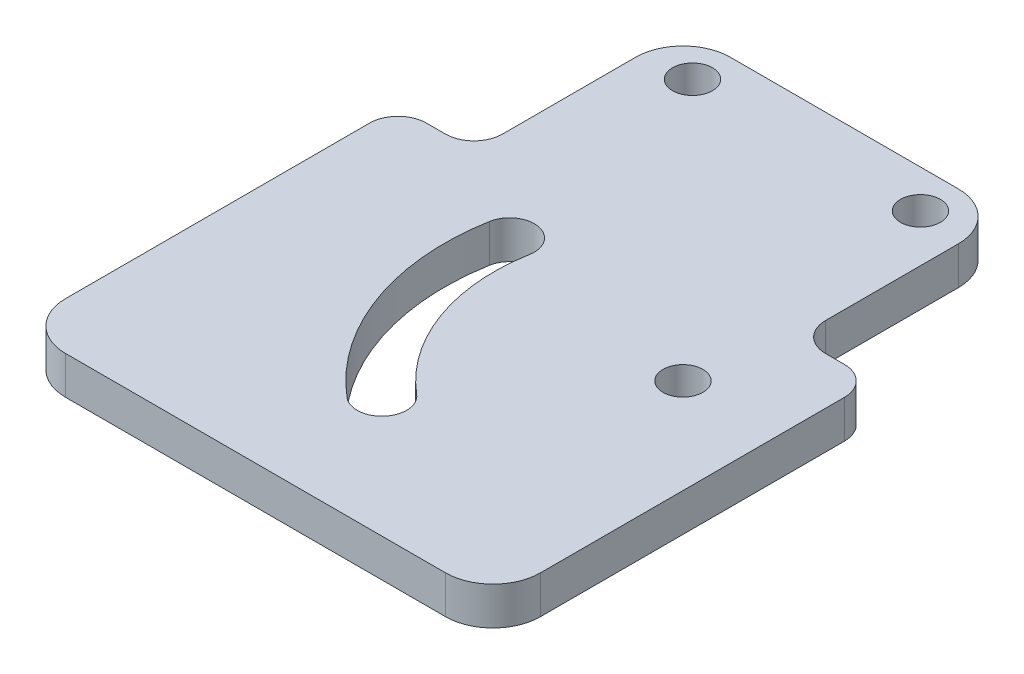
ISO-10303-21;
HEADER;
FILE_DESCRIPTION(('STEP AP214'),'2;1');
FILE_NAME('part.step','',(''),(''),'','','');
FILE_SCHEMA(('AUTOMOTIVE_DESIGN { 1 0 10303 214 1 1 1 1 }'));
ENDSEC;
DATA;
#1=APPLICATION_CONTEXT('core data for automotive mechanical design processes');
#2=APPLICATION_PROTOCOL_DEFINITION('international standard','automotive_design',2000,#1);
#3=PRODUCT_CONTEXT('',#1,'mechanical');
#4=PRODUCT('Part','Part','',(#3));
#5=PRODUCT_RELATED_PRODUCT_CATEGORY('part','',(#4));
#6=PRODUCT_DEFINITION_FORMATION('','',#4);
#7=PRODUCT_DEFINITION_CONTEXT('part definition',#1,'design');
#8=PRODUCT_DEFINITION('design','',#6,#7);
#9=PRODUCT_DEFINITION_SHAPE('','',#8);
#10=(LENGTH_UNIT() NAMED_UNIT(*) SI_UNIT(.MILLI.,.METRE.));
#11=(NAMED_UNIT(*) PLANE_ANGLE_UNIT() SI_UNIT($,.RADIAN.));
#12=(NAMED_UNIT(*) SI_UNIT($,.STERADIAN.) SOLID_ANGLE_UNIT());
#13=UNCERTAINTY_MEASURE_WITH_UNIT(LENGTH_MEASURE(1.E-05),#10,'distance_accuracy_value','');
#14=(GEOMETRIC_REPRESENTATION_CONTEXT(3) GLOBAL_UNCERTAINTY_ASSIGNED_CONTEXT((#13)) GLOBAL_UNIT_ASSIGNED_CONTEXT((#10,
#11,#12)) REPRESENTATION_CONTEXT('',''));
#15=CARTESIAN_POINT('',(0.,0.,0.));
#16=DIRECTION('',(0.,0.,1.));
#17=DIRECTION('',(1.,0.,0.));
#18=AXIS2_PLACEMENT_3D('',#15,#16,#17);
#19=CARTESIAN_POINT('',(-40.,4.,-10.));
#20=DIRECTION('',(0.,0.,1.));
#21=DIRECTION('',(1.,0.,0.));
#22=AXIS2_PLACEMENT_3D('',#19,#20,#21);
#23=PLANE('',#22);
#24=DIRECTION('',(-1.,0.,0.));
#25=VECTOR('',#24,1.);
#26=CARTESIAN_POINT('',(-40.,0.,-10.));
#27=LINE('',#26,#25);
#28=CARTESIAN_POINT('',(-35.,0.,-10.));
#29=VERTEX_POINT('',#28);
#30=CARTESIAN_POINT('',(-37.,0.,-10.));
#31=VERTEX_POINT('',#30);
#32=EDGE_CURVE('E247',#29,#31,#27,.T.);
#33=ORIENTED_EDGE('',*,*,#32,.T.);
#34=DIRECTION('',(0.,-1.,0.));
#35=VECTOR('',#34,1.);
#36=CARTESIAN_POINT('',(-37.,4.,-10.));
#37=LINE('',#36,#35);
#38=CARTESIAN_POINT('',(-37.,4.,-10.));
#39=VERTEX_POINT('',#38);
#40=EDGE_CURVE('E276',#31,#39,#37,.F.);
#41=ORIENTED_EDGE('',*,*,#40,.T.);
#42=DIRECTION('',(-1.,0.,0.));
#43=VECTOR('',#42,1.);
#44=CARTESIAN_POINT('',(-40.,4.,-10.));
#45=LINE('',#44,#43);
#46=CARTESIAN_POINT('',(-35.,4.,-10.));
#47=VERTEX_POINT('',#46);
#48=EDGE_CURVE('E237',#47,#39,#45,.T.);
#49=ORIENTED_EDGE('',*,*,#48,.F.);
#50=DIRECTION('',(0.,1.,0.));
#51=VECTOR('',#50,1.);
#52=CARTESIAN_POINT('',(-35.,4.,-10.));
#53=LINE('',#52,#51);
#54=EDGE_CURVE('E274',#47,#29,#53,.F.);
#55=ORIENTED_EDGE('',*,*,#54,.T.);
#56=EDGE_LOOP('',(#33,#41,#49,#55));
#57=FACE_BOUND('',#56,.T.);
#58=ADVANCED_FACE('F39',(#57),#23,.F.);
#59=CARTESIAN_POINT('',(0.,4.,0.));
#60=DIRECTION('',(0.,1.,0.));
#61=DIRECTION('',(0.,0.,1.));
#62=AXIS2_PLACEMENT_3D('',#59,#60,#61);
#63=PLANE('',#62);
#64=DIRECTION('',(0.,0.,1.));
#65=VECTOR('',#64,1.);
#66=CARTESIAN_POINT('',(2.00000000000001,4.,0.));
#67=LINE('',#66,#65);
#68=CARTESIAN_POINT('',(2.,4.,-27.));
#69=VERTEX_POINT('',#68);
#70=CARTESIAN_POINT('',(2.00000000000001,4.,-13.));
#71=VERTEX_POINT('',#70);
#72=EDGE_CURVE('E350',#69,#71,#67,.T.);
#73=ORIENTED_EDGE('',*,*,#72,.F.);
#74=CARTESIAN_POINT('',(-3.,4.,-27.));
#75=DIRECTION('',(0.,1.,0.));
#76=DIRECTION('',(0.,0.,1.));
#77=AXIS2_PLACEMENT_3D('',#74,#75,#76);
#78=CIRCLE('',#77,5.);
#79=CARTESIAN_POINT('',(-3.,4.,-32.));
#80=VERTEX_POINT('',#79);
#81=EDGE_CURVE('E300',#69,#80,#78,.T.);
#82=ORIENTED_EDGE('',*,*,#81,.T.);
#83=DIRECTION('',(1.,0.,0.));
#84=VECTOR('',#83,1.);
#85=CARTESIAN_POINT('',(0.,4.,-32.));
#86=LINE('',#85,#84);
#87=CARTESIAN_POINT('',(-27.,4.,-32.));
#88=VERTEX_POINT('',#87);
#89=EDGE_CURVE('E354',#88,#80,#86,.T.);
#90=ORIENTED_EDGE('',*,*,#89,.F.);
#91=CARTESIAN_POINT('',(-27.,4.,-27.));
#92=DIRECTION('',(0.,1.,0.));
#93=DIRECTION('',(0.,0.,1.));
#94=AXIS2_PLACEMENT_3D('',#91,#92,#93);
#95=CIRCLE('',#94,5.);
#96=CARTESIAN_POINT('',(-32.,4.,-27.));
#97=VERTEX_POINT('',#96);
#98=EDGE_CURVE('E294',#88,#97,#95,.T.);
#99=ORIENTED_EDGE('',*,*,#98,.T.);
#100=DIRECTION('',(0.,0.,1.));
#101=VECTOR('',#100,1.);
#102=CARTESIAN_POINT('',(-32.,4.,0.));
#103=LINE('',#102,#101);
#104=CARTESIAN_POINT('',(-32.,4.,-13.));
#105=VERTEX_POINT('',#104);
#106=EDGE_CURVE('E356',#97,#105,#103,.T.);
#107=ORIENTED_EDGE('',*,*,#106,.T.);
#108=CARTESIAN_POINT('',(-35.,4.,-13.));
#109=DIRECTION('',(0.,1.,0.));
#110=DIRECTION('',(0.,0.,1.));
#111=AXIS2_PLACEMENT_3D('',#108,#109,#110);
#112=CIRCLE('',#111,3.);
#113=EDGE_CURVE('E286',#105,#47,#112,.F.);
#114=ORIENTED_EDGE('',*,*,#113,.T.);
#115=ORIENTED_EDGE('',*,*,#48,.T.);
#116=CARTESIAN_POINT('',(-37.,4.,-7.));
#117=DIRECTION('',(0.,1.,0.));
#118=DIRECTION('',(0.,0.,1.));
#119=AXIS2_PLACEMENT_3D('',#116,#117,#118);
#120=CIRCLE('',#119,3.);
#121=CARTESIAN_POINT('',(-40.,4.,-7.));
#122=VERTEX_POINT('',#121);
#123=EDGE_CURVE('E264',#39,#122,#120,.T.);
#124=ORIENTED_EDGE('',*,*,#123,.T.);
#125=DIRECTION('',(0.,0.,1.));
#126=VECTOR('',#125,1.);
#127=CARTESIAN_POINT('',(-40.,4.,-10.));
#128=LINE('',#127,#126);
#129=CARTESIAN_POINT('',(-40.,4.,25.));
#130=VERTEX_POINT('',#129);
#131=EDGE_CURVE('E228',#122,#130,#128,.T.);
#132=ORIENTED_EDGE('',*,*,#131,.T.);
#133=CARTESIAN_POINT('',(-35.,4.,25.));
#134=DIRECTION('',(0.,1.,0.));
#135=DIRECTION('',(0.,0.,1.));
#136=AXIS2_PLACEMENT_3D('',#133,#134,#135);
#137=CIRCLE('',#136,5.);
#138=CARTESIAN_POINT('',(-35.,4.,30.));
#139=VERTEX_POINT('',#138);
#140=EDGE_CURVE('E298',#130,#139,#137,.T.);
#141=ORIENTED_EDGE('',*,*,#140,.T.);
#142=DIRECTION('',(1.,0.,0.));
#143=VECTOR('',#142,1.);
#144=CARTESIAN_POINT('',(-40.,4.,30.));
#145=LINE('',#144,#143);
#146=CARTESIAN_POINT('',(5.,4.,30.));
#147=VERTEX_POINT('',#146);
#148=EDGE_CURVE('E231',#139,#147,#145,.T.);
#149=ORIENTED_EDGE('',*,*,#148,.T.);
#150=CARTESIAN_POINT('',(5.00000000000001,4.,25.));
#151=DIRECTION('',(0.,1.,0.));
#152=DIRECTION('',(0.,0.,1.));
#153=AXIS2_PLACEMENT_3D('',#150,#151,#152);
#154=CIRCLE('',#153,5.);
#155=CARTESIAN_POINT('',(10.,4.,25.));
#156=VERTEX_POINT('',#155);
#157=EDGE_CURVE('E296',#147,#156,#154,.T.);
#158=ORIENTED_EDGE('',*,*,#157,.T.);
#159=DIRECTION('',(0.,0.,-1.));
#160=VECTOR('',#159,1.);
#161=CARTESIAN_POINT('',(9.99999999999999,4.,-10.));
#162=LINE('',#161,#160);
#163=CARTESIAN_POINT('',(10.,4.,-7.));
#164=VERTEX_POINT('',#163);
#165=EDGE_CURVE('E235',#156,#164,#162,.T.);
#166=ORIENTED_EDGE('',*,*,#165,.T.);
#167=CARTESIAN_POINT('',(6.99999999999999,4.,-7.));
#168=DIRECTION('',(0.,1.,0.));
#169=DIRECTION('',(0.,0.,1.));
#170=AXIS2_PLACEMENT_3D('',#167,#168,#169);
#171=CIRCLE('',#170,3.);
#172=CARTESIAN_POINT('',(6.99999999999998,4.,-10.));
#173=VERTEX_POINT('',#172);
#174=EDGE_CURVE('E266',#164,#173,#171,.T.);
#175=ORIENTED_EDGE('',*,*,#174,.T.);
#176=CARTESIAN_POINT('',(4.99999999999999,4.,-10.));
#177=VERTEX_POINT('',#176);
#178=EDGE_CURVE('E240',#173,#177,#45,.T.);
#179=ORIENTED_EDGE('',*,*,#178,.T.);
#180=CARTESIAN_POINT('',(5.,4.,-13.));
#181=DIRECTION('',(0.,1.,0.));
#182=DIRECTION('',(0.,0.,1.));
#183=AXIS2_PLACEMENT_3D('',#180,#181,#182);
#184=CIRCLE('',#183,3.);
#185=EDGE_CURVE('E281',#177,#71,#184,.F.);
#186=ORIENTED_EDGE('',*,*,#185,.T.);
#187=EDGE_LOOP('',(#73,#82,#90,#99,#107,#114,#115,#124,#132,#141,#149,#158,#166,#175,#179,#186));
#188=FACE_BOUND('',#187,.T.);
#189=CARTESIAN_POINT('',(0.,4.,0.));
#190=DIRECTION('',(0.,1.,0.));
#191=DIRECTION('',(0.,0.,1.));
#192=AXIS2_PLACEMENT_3D('',#189,#190,#191);
#193=CIRCLE('',#192,2.1);
#194=CARTESIAN_POINT('',(0.,4.,2.1));
#195=VERTEX_POINT('',#194);
#196=EDGE_CURVE('E222',#195,#195,#193,.T.);
#197=ORIENTED_EDGE('',*,*,#196,.F.);
#198=EDGE_LOOP('',(#197));
#199=FACE_BOUND('',#198,.T.);
#200=CARTESIAN_POINT('',(0.,4.,0.));
#201=DIRECTION('',(0.,1.,0.));
#202=DIRECTION('',(0.,0.,1.));
#203=AXIS2_PLACEMENT_3D('',#200,#201,#202);
#204=CIRCLE('',#203,25.1);
#205=CARTESIAN_POINT('',(-24.7186746006064,4.,-4.35856925943977));
#206=VERTEX_POINT('',#205);
#207=CARTESIAN_POINT('',(-16.1339690031321,4.,19.2277155222864));
#208=VERTEX_POINT('',#207);
#209=EDGE_CURVE('E187',#206,#208,#204,.T.);
#210=ORIENTED_EDGE('',*,*,#209,.F.);
#211=CARTESIAN_POINT('',(-22.1581744427747,4.,-3.90708399750578));
#212=DIRECTION('',(0.,1.,0.));
#213=DIRECTION('',(0.,0.,1.));
#214=AXIS2_PLACEMENT_3D('',#211,#212,#213);
#215=CIRCLE('',#214,2.6);
#216=CARTESIAN_POINT('',(-19.597674284943,4.,-3.45559873557177));
#217=VERTEX_POINT('',#216);
#218=EDGE_CURVE('E177',#217,#206,#215,.T.);
#219=ORIENTED_EDGE('',*,*,#218,.F.);
#220=CARTESIAN_POINT('',(0.,4.,0.));
#221=DIRECTION('',(0.,-1.,0.));
#222=DIRECTION('',(0.,0.,1.));
#223=AXIS2_PLACEMENT_3D('',#220,#221,#222);
#224=CIRCLE('',#223,19.9);
#225=CARTESIAN_POINT('',(-12.7914734327621,4.,15.2442844180677));
#226=VERTEX_POINT('',#225);
#227=EDGE_CURVE('E204',#226,#217,#224,.T.);
#228=ORIENTED_EDGE('',*,*,#227,.F.);
#229=CARTESIAN_POINT('',(-14.4627212179471,4.,17.235999970177));
#230=DIRECTION('',(0.,1.,0.));
#231=DIRECTION('',(0.,0.,1.));
#232=AXIS2_PLACEMENT_3D('',#229,#230,#231);
#233=CIRCLE('',#232,2.6);
#234=EDGE_CURVE('E202',#208,#226,#233,.T.);
#235=ORIENTED_EDGE('',*,*,#234,.F.);
#236=EDGE_LOOP('',(#210,#219,#228,#235));
#237=FACE_BOUND('',#236,.T.);
#238=CARTESIAN_POINT('',(-3.,4.,-28.));
#239=DIRECTION('',(0.,1.,0.));
#240=DIRECTION('',(0.,0.,1.));
#241=AXIS2_PLACEMENT_3D('',#238,#239,#240);
#242=CIRCLE('',#241,2.1);
#243=CARTESIAN_POINT('',(-3.,4.,-25.9));
#244=VERTEX_POINT('',#243);
#245=EDGE_CURVE('E362',#244,#244,#242,.T.);
#246=ORIENTED_EDGE('',*,*,#245,.F.);
#247=EDGE_LOOP('',(#246));
#248=FACE_BOUND('',#247,.T.);
#249=CARTESIAN_POINT('',(-27.,4.,-28.));
#250=DIRECTION('',(0.,1.,0.));
#251=DIRECTION('',(0.,0.,1.));
#252=AXIS2_PLACEMENT_3D('',#249,#250,#251);
#253=CIRCLE('',#252,2.1);
#254=CARTESIAN_POINT('',(-27.,4.,-25.9));
#255=VERTEX_POINT('',#254);
#256=EDGE_CURVE('E364',#255,#255,#253,.F.);
#257=ORIENTED_EDGE('',*,*,#256,.T.);
#258=EDGE_LOOP('',(#257));
#259=FACE_BOUND('',#258,.T.);
#260=ADVANCED_FACE('F199',(#188,#199,#237,#248,#259),#63,.T.);
#261=CARTESIAN_POINT('',(0.,0.,0.));
#262=DIRECTION('',(0.,1.,0.));
#263=DIRECTION('',(0.,0.,1.));
#264=AXIS2_PLACEMENT_3D('',#261,#262,#263);
#265=PLANE('',#264);
#266=CARTESIAN_POINT('',(0.,0.,0.));
#267=DIRECTION('',(0.,1.,0.));
#268=DIRECTION('',(0.,0.,1.));
#269=AXIS2_PLACEMENT_3D('',#266,#267,#268);
#270=CIRCLE('',#269,2.1);
#271=CARTESIAN_POINT('',(0.,0.,2.1));
#272=VERTEX_POINT('',#271);
#273=EDGE_CURVE('E195',#272,#272,#270,.T.);
#274=ORIENTED_EDGE('',*,*,#273,.T.);
#275=EDGE_LOOP('',(#274));
#276=FACE_BOUND('',#275,.T.);
#277=DIRECTION('',(1.,0.,0.));
#278=VECTOR('',#277,1.);
#279=CARTESIAN_POINT('',(0.,0.,-32.));
#280=LINE('',#279,#278);
#281=CARTESIAN_POINT('',(-27.,0.,-32.));
#282=VERTEX_POINT('',#281);
#283=CARTESIAN_POINT('',(-3.,0.,-32.));
#284=VERTEX_POINT('',#283);
#285=EDGE_CURVE('E369',#282,#284,#280,.T.);
#286=ORIENTED_EDGE('',*,*,#285,.T.);
#287=CARTESIAN_POINT('',(-3.,0.,-27.));
#288=DIRECTION('',(0.,1.,0.));
#289=DIRECTION('',(0.,0.,1.));
#290=AXIS2_PLACEMENT_3D('',#287,#288,#289);
#291=CIRCLE('',#290,5.);
#292=CARTESIAN_POINT('',(2.,0.,-27.));
#293=VERTEX_POINT('',#292);
#294=EDGE_CURVE('E312',#284,#293,#291,.F.);
#295=ORIENTED_EDGE('',*,*,#294,.T.);
#296=DIRECTION('',(0.,0.,1.));
#297=VECTOR('',#296,1.);
#298=CARTESIAN_POINT('',(2.00000000000001,0.,0.));
#299=LINE('',#298,#297);
#300=CARTESIAN_POINT('',(2.00000000000001,0.,-13.));
#301=VERTEX_POINT('',#300);
#302=EDGE_CURVE('E366',#293,#301,#299,.T.);
#303=ORIENTED_EDGE('',*,*,#302,.T.);
#304=CARTESIAN_POINT('',(5.,0.,-13.));
#305=DIRECTION('',(0.,1.,0.));
#306=DIRECTION('',(0.,0.,1.));
#307=AXIS2_PLACEMENT_3D('',#304,#305,#306);
#308=CIRCLE('',#307,3.);
#309=CARTESIAN_POINT('',(4.99999999999999,0.,-10.));
#310=VERTEX_POINT('',#309);
#311=EDGE_CURVE('E284',#301,#310,#308,.T.);
#312=ORIENTED_EDGE('',*,*,#311,.T.);
#313=CARTESIAN_POINT('',(6.99999999999998,0.,-10.));
#314=VERTEX_POINT('',#313);
#315=EDGE_CURVE('E232',#314,#310,#27,.T.);
#316=ORIENTED_EDGE('',*,*,#315,.F.);
#317=CARTESIAN_POINT('',(6.99999999999999,0.,-7.));
#318=DIRECTION('',(0.,1.,0.));
#319=DIRECTION('',(0.,0.,1.));
#320=AXIS2_PLACEMENT_3D('',#317,#318,#319);
#321=CIRCLE('',#320,3.);
#322=CARTESIAN_POINT('',(10.,0.,-7.));
#323=VERTEX_POINT('',#322);
#324=EDGE_CURVE('E258',#314,#323,#321,.F.);
#325=ORIENTED_EDGE('',*,*,#324,.T.);
#326=DIRECTION('',(0.,0.,-1.));
#327=VECTOR('',#326,1.);
#328=CARTESIAN_POINT('',(9.99999999999999,0.,-10.));
#329=LINE('',#328,#327);
#330=CARTESIAN_POINT('',(10.,0.,25.));
#331=VERTEX_POINT('',#330);
#332=EDGE_CURVE('E245',#331,#323,#329,.T.);
#333=ORIENTED_EDGE('',*,*,#332,.F.);
#334=CARTESIAN_POINT('',(5.00000000000001,0.,25.));
#335=DIRECTION('',(0.,1.,0.));
#336=DIRECTION('',(0.,0.,1.));
#337=AXIS2_PLACEMENT_3D('',#334,#335,#336);
#338=CIRCLE('',#337,5.);
#339=CARTESIAN_POINT('',(5.,0.,30.));
#340=VERTEX_POINT('',#339);
#341=EDGE_CURVE('E309',#331,#340,#338,.F.);
#342=ORIENTED_EDGE('',*,*,#341,.T.);
#343=DIRECTION('',(1.,0.,0.));
#344=VECTOR('',#343,1.);
#345=CARTESIAN_POINT('',(-40.,0.,30.));
#346=LINE('',#345,#344);
#347=CARTESIAN_POINT('',(-35.,0.,30.));
#348=VERTEX_POINT('',#347);
#349=EDGE_CURVE('E242',#348,#340,#346,.T.);
#350=ORIENTED_EDGE('',*,*,#349,.F.);
#351=CARTESIAN_POINT('',(-35.,0.,25.));
#352=DIRECTION('',(0.,1.,0.));
#353=DIRECTION('',(0.,0.,1.));
#354=AXIS2_PLACEMENT_3D('',#351,#352,#353);
#355=CIRCLE('',#354,5.);
#356=CARTESIAN_POINT('',(-40.,0.,25.));
#357=VERTEX_POINT('',#356);
#358=EDGE_CURVE('E60',#348,#357,#355,.F.);
#359=ORIENTED_EDGE('',*,*,#358,.T.);
#360=DIRECTION('',(0.,0.,1.));
#361=VECTOR('',#360,1.);
#362=CARTESIAN_POINT('',(-40.,0.,-10.));
#363=LINE('',#362,#361);
#364=CARTESIAN_POINT('',(-40.,0.,-7.));
#365=VERTEX_POINT('',#364);
#366=EDGE_CURVE('E225',#365,#357,#363,.T.);
#367=ORIENTED_EDGE('',*,*,#366,.F.);
#368=CARTESIAN_POINT('',(-37.,0.,-7.));
#369=DIRECTION('',(0.,1.,0.));
#370=DIRECTION('',(0.,0.,1.));
#371=AXIS2_PLACEMENT_3D('',#368,#369,#370);
#372=CIRCLE('',#371,3.);
#373=EDGE_CURVE('E256',#365,#31,#372,.F.);
#374=ORIENTED_EDGE('',*,*,#373,.T.);
#375=ORIENTED_EDGE('',*,*,#32,.F.);
#376=CARTESIAN_POINT('',(-35.,0.,-13.));
#377=DIRECTION('',(0.,1.,0.));
#378=DIRECTION('',(0.,0.,1.));
#379=AXIS2_PLACEMENT_3D('',#376,#377,#378);
#380=CIRCLE('',#379,3.);
#381=CARTESIAN_POINT('',(-32.,0.,-13.));
#382=VERTEX_POINT('',#381);
#383=EDGE_CURVE('E288',#29,#382,#380,.T.);
#384=ORIENTED_EDGE('',*,*,#383,.T.);
#385=DIRECTION('',(0.,0.,1.));
#386=VECTOR('',#385,1.);
#387=CARTESIAN_POINT('',(-32.,0.,0.));
#388=LINE('',#387,#386);
#389=CARTESIAN_POINT('',(-32.,0.,-27.));
#390=VERTEX_POINT('',#389);
#391=EDGE_CURVE('E372',#390,#382,#388,.T.);
#392=ORIENTED_EDGE('',*,*,#391,.F.);
#393=CARTESIAN_POINT('',(-27.,0.,-27.));
#394=DIRECTION('',(0.,1.,0.));
#395=DIRECTION('',(0.,0.,1.));
#396=AXIS2_PLACEMENT_3D('',#393,#394,#395);
#397=CIRCLE('',#396,5.);
#398=EDGE_CURVE('E307',#390,#282,#397,.F.);
#399=ORIENTED_EDGE('',*,*,#398,.T.);
#400=EDGE_LOOP('',(#286,#295,#303,#312,#316,#325,#333,#342,#350,#359,#367,#374,#375,#384,#392,#399));
#401=FACE_BOUND('',#400,.T.);
#402=CARTESIAN_POINT('',(-22.1581744427747,0.,-3.90708399750578));
#403=DIRECTION('',(0.,1.,0.));
#404=DIRECTION('',(0.,0.,1.));
#405=AXIS2_PLACEMENT_3D('',#402,#403,#404);
#406=CIRCLE('',#405,2.6);
#407=CARTESIAN_POINT('',(-19.597674284943,0.,-3.45559873557177));
#408=VERTEX_POINT('',#407);
#409=CARTESIAN_POINT('',(-24.7186746006064,0.,-4.35856925943977));
#410=VERTEX_POINT('',#409);
#411=EDGE_CURVE('E209',#408,#410,#406,.T.);
#412=ORIENTED_EDGE('',*,*,#411,.T.);
#413=CARTESIAN_POINT('',(0.,0.,0.));
#414=DIRECTION('',(0.,1.,0.));
#415=DIRECTION('',(0.,0.,1.));
#416=AXIS2_PLACEMENT_3D('',#413,#414,#415);
#417=CIRCLE('',#416,25.1);
#418=CARTESIAN_POINT('',(-16.1339690031321,0.,19.2277155222864));
#419=VERTEX_POINT('',#418);
#420=EDGE_CURVE('E194',#410,#419,#417,.T.);
#421=ORIENTED_EDGE('',*,*,#420,.T.);
#422=CARTESIAN_POINT('',(-14.4627212179471,0.,17.235999970177));
#423=DIRECTION('',(0.,1.,0.));
#424=DIRECTION('',(0.,0.,1.));
#425=AXIS2_PLACEMENT_3D('',#422,#423,#424);
#426=CIRCLE('',#425,2.6);
#427=CARTESIAN_POINT('',(-12.7914734327621,0.,15.2442844180677));
#428=VERTEX_POINT('',#427);
#429=EDGE_CURVE('E213',#419,#428,#426,.T.);
#430=ORIENTED_EDGE('',*,*,#429,.T.);
#431=CARTESIAN_POINT('',(0.,0.,0.));
#432=DIRECTION('',(0.,-1.,0.));
#433=DIRECTION('',(0.,0.,1.));
#434=AXIS2_PLACEMENT_3D('',#431,#432,#433);
#435=CIRCLE('',#434,19.9);
#436=EDGE_CURVE('E188',#428,#408,#435,.T.);
#437=ORIENTED_EDGE('',*,*,#436,.T.);
#438=EDGE_LOOP('',(#412,#421,#430,#437));
#439=FACE_BOUND('',#438,.T.);
#440=CARTESIAN_POINT('',(-3.,0.,-28.));
#441=DIRECTION('',(0.,1.,0.));
#442=DIRECTION('',(0.,0.,1.));
#443=AXIS2_PLACEMENT_3D('',#440,#441,#442);
#444=CIRCLE('',#443,2.1);
#445=CARTESIAN_POINT('',(-3.,0.,-25.9));
#446=VERTEX_POINT('',#445);
#447=EDGE_CURVE('E375',#446,#446,#444,.T.);
#448=ORIENTED_EDGE('',*,*,#447,.T.);
#449=EDGE_LOOP('',(#448));
#450=FACE_BOUND('',#449,.T.);
#451=CARTESIAN_POINT('',(-27.,0.,-28.));
#452=DIRECTION('',(0.,1.,0.));
#453=DIRECTION('',(0.,0.,1.));
#454=AXIS2_PLACEMENT_3D('',#451,#452,#453);
#455=CIRCLE('',#454,2.1);
#456=CARTESIAN_POINT('',(-27.,0.,-25.9));
#457=VERTEX_POINT('',#456);
#458=EDGE_CURVE('E211',#457,#457,#455,.F.);
#459=ORIENTED_EDGE('',*,*,#458,.F.);
#460=EDGE_LOOP('',(#459));
#461=FACE_BOUND('',#460,.T.);
#462=ADVANCED_FACE('F329',(#276,#401,#439,#450,#461),#265,.F.);
#463=CARTESIAN_POINT('',(-40.,4.,-10.));
#464=DIRECTION('',(1.,0.,0.));
#465=DIRECTION('',(0.,0.,-1.));
#466=AXIS2_PLACEMENT_3D('',#463,#464,#465);
#467=PLANE('',#466);
#468=ORIENTED_EDGE('',*,*,#366,.T.);
#469=DIRECTION('',(0.,-1.,0.));
#470=VECTOR('',#469,1.);
#471=CARTESIAN_POINT('',(-40.,4.,25.));
#472=LINE('',#471,#470);
#473=EDGE_CURVE('E319',#357,#130,#472,.F.);
#474=ORIENTED_EDGE('',*,*,#473,.T.);
#475=ORIENTED_EDGE('',*,*,#131,.F.);
#476=DIRECTION('',(0.,-1.,0.));
#477=VECTOR('',#476,1.);
#478=CARTESIAN_POINT('',(-40.,4.,-7.));
#479=LINE('',#478,#477);
#480=EDGE_CURVE('E271',#122,#365,#479,.T.);
#481=ORIENTED_EDGE('',*,*,#480,.T.);
#482=EDGE_LOOP('',(#468,#474,#475,#481));
#483=FACE_BOUND('',#482,.T.);
#484=ADVANCED_FACE('F386',(#483),#467,.F.);
#485=CARTESIAN_POINT('',(-40.,4.,30.));
#486=DIRECTION('',(0.,0.,-1.));
#487=DIRECTION('',(-1.,0.,0.));
#488=AXIS2_PLACEMENT_3D('',#485,#486,#487);
#489=PLANE('',#488);
#490=ORIENTED_EDGE('',*,*,#148,.F.);
#491=DIRECTION('',(0.,-1.,0.));
#492=VECTOR('',#491,1.);
#493=CARTESIAN_POINT('',(-35.,4.,30.));
#494=LINE('',#493,#492);
#495=EDGE_CURVE('E316',#139,#348,#494,.T.);
#496=ORIENTED_EDGE('',*,*,#495,.T.);
#497=ORIENTED_EDGE('',*,*,#349,.T.);
#498=DIRECTION('',(0.,-1.,0.));
#499=VECTOR('',#498,1.);
#500=CARTESIAN_POINT('',(5.,4.,30.));
#501=LINE('',#500,#499);
#502=EDGE_CURVE('E314',#340,#147,#501,.F.);
#503=ORIENTED_EDGE('',*,*,#502,.T.);
#504=EDGE_LOOP('',(#490,#496,#497,#503));
#505=FACE_BOUND('',#504,.T.);
#506=ADVANCED_FACE('F393',(#505),#489,.F.);
#507=CARTESIAN_POINT('',(9.99999999999999,4.,-10.));
#508=DIRECTION('',(-1.,0.,0.));
#509=DIRECTION('',(0.,0.,1.));
#510=AXIS2_PLACEMENT_3D('',#507,#508,#509);
#511=PLANE('',#510);
#512=ORIENTED_EDGE('',*,*,#165,.F.);
#513=DIRECTION('',(0.,-1.,0.));
#514=VECTOR('',#513,1.);
#515=CARTESIAN_POINT('',(10.,4.,25.));
#516=LINE('',#515,#514);
#517=EDGE_CURVE('E47',#156,#331,#516,.T.);
#518=ORIENTED_EDGE('',*,*,#517,.T.);
#519=ORIENTED_EDGE('',*,*,#332,.T.);
#520=DIRECTION('',(0.,-1.,0.));
#521=VECTOR('',#520,1.);
#522=CARTESIAN_POINT('',(10.,4.,-7.));
#523=LINE('',#522,#521);
#524=EDGE_CURVE('E261',#323,#164,#523,.F.);
#525=ORIENTED_EDGE('',*,*,#524,.T.);
#526=EDGE_LOOP('',(#512,#518,#519,#525));
#527=FACE_BOUND('',#526,.T.);
#528=ADVANCED_FACE('F325',(#527),#511,.F.);
#529=ORIENTED_EDGE('',*,*,#178,.F.);
#530=DIRECTION('',(0.,-1.,0.));
#531=VECTOR('',#530,1.);
#532=CARTESIAN_POINT('',(6.99999999999999,4.,-10.));
#533=LINE('',#532,#531);
#534=EDGE_CURVE('E253',#173,#314,#533,.T.);
#535=ORIENTED_EDGE('',*,*,#534,.T.);
#536=ORIENTED_EDGE('',*,*,#315,.T.);
#537=DIRECTION('',(0.,1.,0.));
#538=VECTOR('',#537,1.);
#539=CARTESIAN_POINT('',(5.,4.,-10.));
#540=LINE('',#539,#538);
#541=EDGE_CURVE('E250',#310,#177,#540,.T.);
#542=ORIENTED_EDGE('',*,*,#541,.T.);
#543=EDGE_LOOP('',(#529,#535,#536,#542));
#544=FACE_BOUND('',#543,.T.);
#545=ADVANCED_FACE('F344',(#544),#23,.F.);
#546=CARTESIAN_POINT('',(0.,4.,0.));
#547=DIRECTION('',(0.,-1.,0.));
#548=DIRECTION('',(0.,0.,-1.));
#549=AXIS2_PLACEMENT_3D('',#546,#547,#548);
#550=CYLINDRICAL_SURFACE('',#549,2.1);
#551=ORIENTED_EDGE('',*,*,#196,.T.);
#552=EDGE_LOOP('',(#551));
#553=FACE_BOUND('',#552,.T.);
#554=ORIENTED_EDGE('',*,*,#273,.F.);
#555=EDGE_LOOP('',(#554));
#556=FACE_BOUND('',#555,.T.);
#557=ADVANCED_FACE('F404',(#553,#556),#550,.F.);
#558=CARTESIAN_POINT('',(-22.1581744427747,4.,-3.90708399750578));
#559=DIRECTION('',(0.,-1.,0.));
#560=DIRECTION('',(0.,0.,-1.));
#561=AXIS2_PLACEMENT_3D('',#558,#559,#560);
#562=CYLINDRICAL_SURFACE('',#561,2.6);
#563=ORIENTED_EDGE('',*,*,#411,.F.);
#564=DIRECTION('',(0.,-1.,0.));
#565=VECTOR('',#564,1.);
#566=CARTESIAN_POINT('',(-19.597674284943,4.,-3.45559873557177));
#567=LINE('',#566,#565);
#568=EDGE_CURVE('E183',#217,#408,#567,.T.);
#569=ORIENTED_EDGE('',*,*,#568,.F.);
#570=ORIENTED_EDGE('',*,*,#218,.T.);
#571=DIRECTION('',(0.,-1.,0.));
#572=VECTOR('',#571,1.);
#573=CARTESIAN_POINT('',(-24.7186746006064,4.,-4.35856925943977));
#574=LINE('',#573,#572);
#575=EDGE_CURVE('E180',#206,#410,#574,.T.);
#576=ORIENTED_EDGE('',*,*,#575,.T.);
#577=EDGE_LOOP('',(#563,#569,#570,#576));
#578=FACE_BOUND('',#577,.T.);
#579=ADVANCED_FACE('F179',(#578),#562,.F.);
#580=CARTESIAN_POINT('',(0.,4.,0.));
#581=DIRECTION('',(0.,-1.,0.));
#582=DIRECTION('',(0.,0.,-1.));
#583=AXIS2_PLACEMENT_3D('',#580,#581,#582);
#584=CYLINDRICAL_SURFACE('',#583,25.1);
#585=ORIENTED_EDGE('',*,*,#420,.F.);
#586=ORIENTED_EDGE('',*,*,#575,.F.);
#587=ORIENTED_EDGE('',*,*,#209,.T.);
#588=DIRECTION('',(0.,-1.,0.));
#589=VECTOR('',#588,1.);
#590=CARTESIAN_POINT('',(-16.1339690031321,4.,19.2277155222864));
#591=LINE('',#590,#589);
#592=EDGE_CURVE('E196',#208,#419,#591,.T.);
#593=ORIENTED_EDGE('',*,*,#592,.T.);
#594=EDGE_LOOP('',(#585,#586,#587,#593));
#595=FACE_BOUND('',#594,.T.);
#596=ADVANCED_FACE('F191',(#595),#584,.F.);
#597=CARTESIAN_POINT('',(-14.4627212179471,4.,17.235999970177));
#598=DIRECTION('',(0.,-1.,0.));
#599=DIRECTION('',(0.,0.,-1.));
#600=AXIS2_PLACEMENT_3D('',#597,#598,#599);
#601=CYLINDRICAL_SURFACE('',#600,2.6);
#602=ORIENTED_EDGE('',*,*,#429,.F.);
#603=ORIENTED_EDGE('',*,*,#592,.F.);
#604=ORIENTED_EDGE('',*,*,#234,.T.);
#605=DIRECTION('',(0.,-1.,0.));
#606=VECTOR('',#605,1.);
#607=CARTESIAN_POINT('',(-12.7914734327621,4.,15.2442844180677));
#608=LINE('',#607,#606);
#609=EDGE_CURVE('E219',#226,#428,#608,.T.);
#610=ORIENTED_EDGE('',*,*,#609,.T.);
#611=EDGE_LOOP('',(#602,#603,#604,#610));
#612=FACE_BOUND('',#611,.T.);
#613=ADVANCED_FACE('F482',(#612),#601,.F.);
#614=CARTESIAN_POINT('',(0.,4.,0.));
#615=DIRECTION('',(0.,-1.,0.));
#616=DIRECTION('',(0.,0.,-1.));
#617=AXIS2_PLACEMENT_3D('',#614,#615,#616);
#618=CYLINDRICAL_SURFACE('',#617,19.9);
#619=ORIENTED_EDGE('',*,*,#436,.F.);
#620=ORIENTED_EDGE('',*,*,#609,.F.);
#621=ORIENTED_EDGE('',*,*,#227,.T.);
#622=ORIENTED_EDGE('',*,*,#568,.T.);
#623=EDGE_LOOP('',(#619,#620,#621,#622));
#624=FACE_BOUND('',#623,.T.);
#625=ADVANCED_FACE('F474',(#624),#618,.T.);
#626=CARTESIAN_POINT('',(2.00000000000001,0.,0.));
#627=DIRECTION('',(-1.,0.,0.));
#628=DIRECTION('',(0.,0.,1.));
#629=AXIS2_PLACEMENT_3D('',#626,#627,#628);
#630=PLANE('',#629);
#631=ORIENTED_EDGE('',*,*,#302,.F.);
#632=DIRECTION('',(0.,1.,0.));
#633=VECTOR('',#632,1.);
#634=CARTESIAN_POINT('',(2.,0.,-27.));
#635=LINE('',#634,#633);
#636=EDGE_CURVE('E291',#293,#69,#635,.T.);
#637=ORIENTED_EDGE('',*,*,#636,.T.);
#638=ORIENTED_EDGE('',*,*,#72,.T.);
#639=DIRECTION('',(0.,1.,0.));
#640=VECTOR('',#639,1.);
#641=CARTESIAN_POINT('',(2.00000000000001,0.,-13.));
#642=LINE('',#641,#640);
#643=EDGE_CURVE('E268',#71,#301,#642,.F.);
#644=ORIENTED_EDGE('',*,*,#643,.T.);
#645=EDGE_LOOP('',(#631,#637,#638,#644));
#646=FACE_BOUND('',#645,.T.);
#647=ADVANCED_FACE('F466',(#646),#630,.F.);
#648=CARTESIAN_POINT('',(-32.,0.,0.));
#649=DIRECTION('',(-1.,0.,0.));
#650=DIRECTION('',(0.,0.,1.));
#651=AXIS2_PLACEMENT_3D('',#648,#649,#650);
#652=PLANE('',#651);
#653=ORIENTED_EDGE('',*,*,#106,.F.);
#654=DIRECTION('',(0.,1.,0.));
#655=VECTOR('',#654,1.);
#656=CARTESIAN_POINT('',(-32.,0.,-27.));
#657=LINE('',#656,#655);
#658=EDGE_CURVE('E11',#97,#390,#657,.F.);
#659=ORIENTED_EDGE('',*,*,#658,.T.);
#660=ORIENTED_EDGE('',*,*,#391,.T.);
#661=DIRECTION('',(0.,1.,0.));
#662=VECTOR('',#661,1.);
#663=CARTESIAN_POINT('',(-32.,0.,-13.));
#664=LINE('',#663,#662);
#665=EDGE_CURVE('E278',#382,#105,#664,.T.);
#666=ORIENTED_EDGE('',*,*,#665,.T.);
#667=EDGE_LOOP('',(#653,#659,#660,#666));
#668=FACE_BOUND('',#667,.T.);
#669=ADVANCED_FACE('F463',(#668),#652,.T.);
#670=CARTESIAN_POINT('',(-3.,0.,-28.));
#671=DIRECTION('',(0.,1.,0.));
#672=DIRECTION('',(0.,0.,1.));
#673=AXIS2_PLACEMENT_3D('',#670,#671,#672);
#674=CYLINDRICAL_SURFACE('',#673,2.1);
#675=ORIENTED_EDGE('',*,*,#447,.F.);
#676=EDGE_LOOP('',(#675));
#677=FACE_BOUND('',#676,.T.);
#678=ORIENTED_EDGE('',*,*,#245,.T.);
#679=EDGE_LOOP('',(#678));
#680=FACE_BOUND('',#679,.T.);
#681=ADVANCED_FACE('F465',(#677,#680),#674,.F.);
#682=CARTESIAN_POINT('',(0.,0.,-32.));
#683=DIRECTION('',(0.,0.,1.));
#684=DIRECTION('',(1.,0.,0.));
#685=AXIS2_PLACEMENT_3D('',#682,#683,#684);
#686=PLANE('',#685);
#687=ORIENTED_EDGE('',*,*,#89,.T.);
#688=DIRECTION('',(0.,1.,0.));
#689=VECTOR('',#688,1.);
#690=CARTESIAN_POINT('',(-3.,0.,-32.));
#691=LINE('',#690,#689);
#692=EDGE_CURVE('E305',#80,#284,#691,.F.);
#693=ORIENTED_EDGE('',*,*,#692,.T.);
#694=ORIENTED_EDGE('',*,*,#285,.F.);
#695=DIRECTION('',(0.,1.,0.));
#696=VECTOR('',#695,1.);
#697=CARTESIAN_POINT('',(-27.,4.,-32.));
#698=LINE('',#697,#696);
#699=EDGE_CURVE('E302',#282,#88,#698,.T.);
#700=ORIENTED_EDGE('',*,*,#699,.T.);
#701=EDGE_LOOP('',(#687,#693,#694,#700));
#702=FACE_BOUND('',#701,.T.);
#703=ADVANCED_FACE('F461',(#702),#686,.F.);
#704=CARTESIAN_POINT('',(-27.,0.,-28.));
#705=DIRECTION('',(0.,1.,0.));
#706=DIRECTION('',(0.,0.,1.));
#707=AXIS2_PLACEMENT_3D('',#704,#705,#706);
#708=CYLINDRICAL_SURFACE('',#707,2.1);
#709=ORIENTED_EDGE('',*,*,#458,.T.);
#710=EDGE_LOOP('',(#709));
#711=FACE_BOUND('',#710,.T.);
#712=ORIENTED_EDGE('',*,*,#256,.F.);
#713=EDGE_LOOP('',(#712));
#714=FACE_BOUND('',#713,.T.);
#715=ADVANCED_FACE('F382',(#711,#714),#708,.F.);
#716=CARTESIAN_POINT('',(6.99999999999999,4.,-7.));
#717=DIRECTION('',(0.,-1.,0.));
#718=DIRECTION('',(0.,0.,-1.));
#719=AXIS2_PLACEMENT_3D('',#716,#717,#718);
#720=CYLINDRICAL_SURFACE('',#719,3.);
#721=ORIENTED_EDGE('',*,*,#174,.F.);
#722=ORIENTED_EDGE('',*,*,#524,.F.);
#723=ORIENTED_EDGE('',*,*,#324,.F.);
#724=ORIENTED_EDGE('',*,*,#534,.F.);
#725=EDGE_LOOP('',(#721,#722,#723,#724));
#726=FACE_BOUND('',#725,.T.);
#727=ADVANCED_FACE('F337',(#726),#720,.T.);
#728=CARTESIAN_POINT('',(5.,4.,-13.));
#729=DIRECTION('',(0.,-1.,0.));
#730=DIRECTION('',(0.,0.,-1.));
#731=AXIS2_PLACEMENT_3D('',#728,#729,#730);
#732=CYLINDRICAL_SURFACE('',#731,3.);
#733=ORIENTED_EDGE('',*,*,#311,.F.);
#734=ORIENTED_EDGE('',*,*,#643,.F.);
#735=ORIENTED_EDGE('',*,*,#185,.F.);
#736=ORIENTED_EDGE('',*,*,#541,.F.);
#737=EDGE_LOOP('',(#733,#734,#735,#736));
#738=FACE_BOUND('',#737,.T.);
#739=ADVANCED_FACE('F348',(#738),#732,.F.);
#740=CARTESIAN_POINT('',(-37.,4.,-7.));
#741=DIRECTION('',(0.,-1.,0.));
#742=DIRECTION('',(0.,0.,-1.));
#743=AXIS2_PLACEMENT_3D('',#740,#741,#742);
#744=CYLINDRICAL_SURFACE('',#743,3.);
#745=ORIENTED_EDGE('',*,*,#123,.F.);
#746=ORIENTED_EDGE('',*,*,#40,.F.);
#747=ORIENTED_EDGE('',*,*,#373,.F.);
#748=ORIENTED_EDGE('',*,*,#480,.F.);
#749=EDGE_LOOP('',(#745,#746,#747,#748));
#750=FACE_BOUND('',#749,.T.);
#751=ADVANCED_FACE('F421',(#750),#744,.T.);
#752=CARTESIAN_POINT('',(-35.,0.,-13.));
#753=DIRECTION('',(0.,1.,0.));
#754=DIRECTION('',(0.,0.,1.));
#755=AXIS2_PLACEMENT_3D('',#752,#753,#754);
#756=CYLINDRICAL_SURFACE('',#755,3.);
#757=ORIENTED_EDGE('',*,*,#383,.F.);
#758=ORIENTED_EDGE('',*,*,#54,.F.);
#759=ORIENTED_EDGE('',*,*,#113,.F.);
#760=ORIENTED_EDGE('',*,*,#665,.F.);
#761=EDGE_LOOP('',(#757,#758,#759,#760));
#762=FACE_BOUND('',#761,.T.);
#763=ADVANCED_FACE('F424',(#762),#756,.F.);
#764=CARTESIAN_POINT('',(-3.,0.,-27.));
#765=DIRECTION('',(0.,1.,0.));
#766=DIRECTION('',(0.,0.,1.));
#767=AXIS2_PLACEMENT_3D('',#764,#765,#766);
#768=CYLINDRICAL_SURFACE('',#767,5.);
#769=ORIENTED_EDGE('',*,*,#294,.F.);
#770=ORIENTED_EDGE('',*,*,#692,.F.);
#771=ORIENTED_EDGE('',*,*,#81,.F.);
#772=ORIENTED_EDGE('',*,*,#636,.F.);
#773=EDGE_LOOP('',(#769,#770,#771,#772));
#774=FACE_BOUND('',#773,.T.);
#775=ADVANCED_FACE('F428',(#774),#768,.T.);
#776=CARTESIAN_POINT('',(-35.,4.,25.));
#777=DIRECTION('',(0.,-1.,0.));
#778=DIRECTION('',(0.,0.,-1.));
#779=AXIS2_PLACEMENT_3D('',#776,#777,#778);
#780=CYLINDRICAL_SURFACE('',#779,5.);
#781=ORIENTED_EDGE('',*,*,#140,.F.);
#782=ORIENTED_EDGE('',*,*,#473,.F.);
#783=ORIENTED_EDGE('',*,*,#358,.F.);
#784=ORIENTED_EDGE('',*,*,#495,.F.);
#785=EDGE_LOOP('',(#781,#782,#783,#784));
#786=FACE_BOUND('',#785,.T.);
#787=ADVANCED_FACE('F432',(#786),#780,.T.);
#788=CARTESIAN_POINT('',(5.00000000000001,4.,25.));
#789=DIRECTION('',(0.,-1.,0.));
#790=DIRECTION('',(0.,0.,-1.));
#791=AXIS2_PLACEMENT_3D('',#788,#789,#790);
#792=CYLINDRICAL_SURFACE('',#791,5.);
#793=ORIENTED_EDGE('',*,*,#157,.F.);
#794=ORIENTED_EDGE('',*,*,#502,.F.);
#795=ORIENTED_EDGE('',*,*,#341,.F.);
#796=ORIENTED_EDGE('',*,*,#517,.F.);
#797=EDGE_LOOP('',(#793,#794,#795,#796));
#798=FACE_BOUND('',#797,.T.);
#799=ADVANCED_FACE('F435',(#798),#792,.T.);
#800=CARTESIAN_POINT('',(-27.,0.,-27.));
#801=DIRECTION('',(0.,-1.,0.));
#802=DIRECTION('',(0.,0.,-1.));
#803=AXIS2_PLACEMENT_3D('',#800,#801,#802);
#804=CYLINDRICAL_SURFACE('',#803,5.);
#805=ORIENTED_EDGE('',*,*,#398,.F.);
#806=ORIENTED_EDGE('',*,*,#658,.F.);
#807=ORIENTED_EDGE('',*,*,#98,.F.);
#808=ORIENTED_EDGE('',*,*,#699,.F.);
#809=EDGE_LOOP('',(#805,#806,#807,#808));
#810=FACE_BOUND('',#809,.T.);
#811=ADVANCED_FACE('F41',(#810),#804,.T.);
#812=CLOSED_SHELL('',(#58,#260,#462,#484,#506,#528,#545,#557,#579,#596,#613,#625,#647,#669,#681,
#703,#715,#727,#739,#751,#763,#775,#787,#799,#811));
#813=MANIFOLD_SOLID_BREP('B2',#812);
#814=ADVANCED_BREP_SHAPE_REPRESENTATION('',(#18,#813),#14);
#815=SHAPE_DEFINITION_REPRESENTATION(#9,#814);
ENDSEC;
END-ISO-10303-21;
